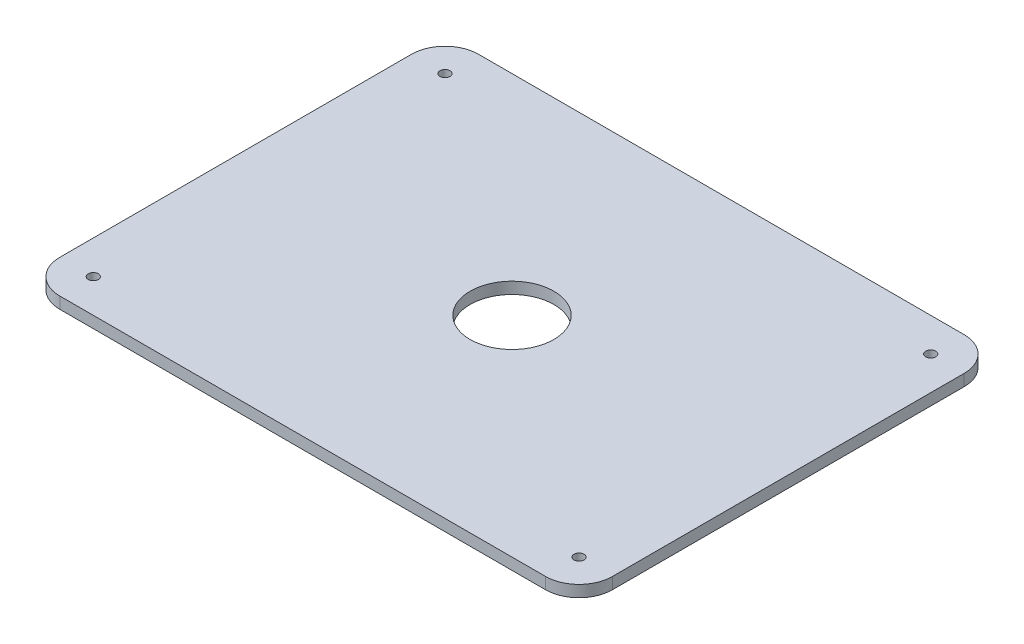
ISO-10303-21;
HEADER;
FILE_DESCRIPTION(('STEP AP214'),'2;1');
FILE_NAME('part.step','',(''),(''),'','','');
FILE_SCHEMA(('AUTOMOTIVE_DESIGN { 1 0 10303 214 1 1 1 1 }'));
ENDSEC;
DATA;
#1=APPLICATION_CONTEXT('core data for automotive mechanical design processes');
#2=APPLICATION_PROTOCOL_DEFINITION('international standard','automotive_design',2000,#1);
#3=PRODUCT_CONTEXT('',#1,'mechanical');
#4=PRODUCT('Part','Part','',(#3));
#5=PRODUCT_RELATED_PRODUCT_CATEGORY('part','',(#4));
#6=PRODUCT_DEFINITION_FORMATION('','',#4);
#7=PRODUCT_DEFINITION_CONTEXT('part definition',#1,'design');
#8=PRODUCT_DEFINITION('design','',#6,#7);
#9=PRODUCT_DEFINITION_SHAPE('','',#8);
#10=(LENGTH_UNIT() NAMED_UNIT(*) SI_UNIT(.MILLI.,.METRE.));
#11=(NAMED_UNIT(*) PLANE_ANGLE_UNIT() SI_UNIT($,.RADIAN.));
#12=(NAMED_UNIT(*) SI_UNIT($,.STERADIAN.) SOLID_ANGLE_UNIT());
#13=UNCERTAINTY_MEASURE_WITH_UNIT(LENGTH_MEASURE(1.E-05),#10,'distance_accuracy_value','');
#14=(GEOMETRIC_REPRESENTATION_CONTEXT(3) GLOBAL_UNCERTAINTY_ASSIGNED_CONTEXT((#13)) GLOBAL_UNIT_ASSIGNED_CONTEXT((#10,
#11,#12)) REPRESENTATION_CONTEXT('',''));
#15=CARTESIAN_POINT('',(0.,0.,0.));
#16=DIRECTION('',(0.,0.,1.));
#17=DIRECTION('',(1.,0.,0.));
#18=AXIS2_PLACEMENT_3D('',#15,#16,#17);
#19=CARTESIAN_POINT('',(-165.,6.9,125.));
#20=DIRECTION('',(1.,0.,0.));
#21=DIRECTION('',(0.,0.,-1.));
#22=AXIS2_PLACEMENT_3D('',#19,#20,#21);
#23=PLANE('',#22);
#24=DIRECTION('',(0.,0.,1.));
#25=VECTOR('',#24,1.);
#26=CARTESIAN_POINT('',(-165.,6.9,125.));
#27=LINE('',#26,#25);
#28=CARTESIAN_POINT('',(-165.,6.9,-105.));
#29=VERTEX_POINT('',#28);
#30=CARTESIAN_POINT('',(-165.,6.9,105.));
#31=VERTEX_POINT('',#30);
#32=EDGE_CURVE('E135',#29,#31,#27,.T.);
#33=ORIENTED_EDGE('',*,*,#32,.F.);
#34=DIRECTION('',(0.,-1.,0.));
#35=VECTOR('',#34,1.);
#36=CARTESIAN_POINT('',(-165.,6.9,-105.));
#37=LINE('',#36,#35);
#38=CARTESIAN_POINT('',(-165.,0.,-105.));
#39=VERTEX_POINT('',#38);
#40=EDGE_CURVE('E174',#29,#39,#37,.T.);
#41=ORIENTED_EDGE('',*,*,#40,.T.);
#42=DIRECTION('',(0.,0.,1.));
#43=VECTOR('',#42,1.);
#44=CARTESIAN_POINT('',(-165.,0.,125.));
#45=LINE('',#44,#43);
#46=CARTESIAN_POINT('',(-165.,0.,105.));
#47=VERTEX_POINT('',#46);
#48=EDGE_CURVE('E189',#39,#47,#45,.T.);
#49=ORIENTED_EDGE('',*,*,#48,.T.);
#50=DIRECTION('',(0.,-1.,0.));
#51=VECTOR('',#50,1.);
#52=CARTESIAN_POINT('',(-165.,6.9,105.));
#53=LINE('',#52,#51);
#54=EDGE_CURVE('E171',#47,#31,#53,.F.);
#55=ORIENTED_EDGE('',*,*,#54,.T.);
#56=EDGE_LOOP('',(#33,#41,#49,#55));
#57=FACE_BOUND('',#56,.T.);
#58=ADVANCED_FACE('F39',(#57),#23,.F.);
#59=CARTESIAN_POINT('',(-165.,6.9,125.));
#60=DIRECTION('',(0.,0.,-1.));
#61=DIRECTION('',(-1.,0.,0.));
#62=AXIS2_PLACEMENT_3D('',#59,#60,#61);
#63=PLANE('',#62);
#64=DIRECTION('',(1.,0.,0.));
#65=VECTOR('',#64,1.);
#66=CARTESIAN_POINT('',(-165.,6.9,125.));
#67=LINE('',#66,#65);
#68=CARTESIAN_POINT('',(-145.,6.9,125.));
#69=VERTEX_POINT('',#68);
#70=CARTESIAN_POINT('',(145.,6.9,125.));
#71=VERTEX_POINT('',#70);
#72=EDGE_CURVE('E140',#69,#71,#67,.T.);
#73=ORIENTED_EDGE('',*,*,#72,.F.);
#74=DIRECTION('',(0.,-1.,0.));
#75=VECTOR('',#74,1.);
#76=CARTESIAN_POINT('',(-145.,6.9,125.));
#77=LINE('',#76,#75);
#78=CARTESIAN_POINT('',(-145.,0.,125.));
#79=VERTEX_POINT('',#78);
#80=EDGE_CURVE('E11',#69,#79,#77,.T.);
#81=ORIENTED_EDGE('',*,*,#80,.T.);
#82=DIRECTION('',(1.,0.,0.));
#83=VECTOR('',#82,1.);
#84=CARTESIAN_POINT('',(-165.,0.,125.));
#85=LINE('',#84,#83);
#86=CARTESIAN_POINT('',(145.,0.,125.));
#87=VERTEX_POINT('',#86);
#88=EDGE_CURVE('E142',#79,#87,#85,.T.);
#89=ORIENTED_EDGE('',*,*,#88,.T.);
#90=DIRECTION('',(0.,-1.,0.));
#91=VECTOR('',#90,1.);
#92=CARTESIAN_POINT('',(145.,6.9,125.));
#93=LINE('',#92,#91);
#94=EDGE_CURVE('E48',#87,#71,#93,.F.);
#95=ORIENTED_EDGE('',*,*,#94,.T.);
#96=EDGE_LOOP('',(#73,#81,#89,#95));
#97=FACE_BOUND('',#96,.T.);
#98=ADVANCED_FACE('F195',(#97),#63,.F.);
#99=CARTESIAN_POINT('',(165.,6.9,125.));
#100=DIRECTION('',(-1.,0.,0.));
#101=DIRECTION('',(0.,0.,1.));
#102=AXIS2_PLACEMENT_3D('',#99,#100,#101);
#103=PLANE('',#102);
#104=DIRECTION('',(0.,0.,-1.));
#105=VECTOR('',#104,1.);
#106=CARTESIAN_POINT('',(165.,0.,125.));
#107=LINE('',#106,#105);
#108=CARTESIAN_POINT('',(165.,0.,105.));
#109=VERTEX_POINT('',#108);
#110=CARTESIAN_POINT('',(165.,0.,-105.));
#111=VERTEX_POINT('',#110);
#112=EDGE_CURVE('E136',#109,#111,#107,.T.);
#113=ORIENTED_EDGE('',*,*,#112,.T.);
#114=DIRECTION('',(0.,-1.,0.));
#115=VECTOR('',#114,1.);
#116=CARTESIAN_POINT('',(165.,6.9,-105.));
#117=LINE('',#116,#115);
#118=CARTESIAN_POINT('',(165.,6.9,-105.));
#119=VERTEX_POINT('',#118);
#120=EDGE_CURVE('E111',#111,#119,#117,.F.);
#121=ORIENTED_EDGE('',*,*,#120,.T.);
#122=DIRECTION('',(0.,0.,-1.));
#123=VECTOR('',#122,1.);
#124=CARTESIAN_POINT('',(165.,6.9,125.));
#125=LINE('',#124,#123);
#126=CARTESIAN_POINT('',(165.,6.9,105.));
#127=VERTEX_POINT('',#126);
#128=EDGE_CURVE('E180',#127,#119,#125,.T.);
#129=ORIENTED_EDGE('',*,*,#128,.F.);
#130=DIRECTION('',(0.,-1.,0.));
#131=VECTOR('',#130,1.);
#132=CARTESIAN_POINT('',(165.,6.9,105.));
#133=LINE('',#132,#131);
#134=EDGE_CURVE('E117',#127,#109,#133,.T.);
#135=ORIENTED_EDGE('',*,*,#134,.T.);
#136=EDGE_LOOP('',(#113,#121,#129,#135));
#137=FACE_BOUND('',#136,.T.);
#138=ADVANCED_FACE('F202',(#137),#103,.F.);
#139=CARTESIAN_POINT('',(-165.,6.9,-125.));
#140=DIRECTION('',(0.,0.,1.));
#141=DIRECTION('',(1.,0.,0.));
#142=AXIS2_PLACEMENT_3D('',#139,#140,#141);
#143=PLANE('',#142);
#144=DIRECTION('',(-1.,0.,0.));
#145=VECTOR('',#144,1.);
#146=CARTESIAN_POINT('',(-165.,6.9,-125.));
#147=LINE('',#146,#145);
#148=CARTESIAN_POINT('',(145.,6.9,-125.));
#149=VERTEX_POINT('',#148);
#150=CARTESIAN_POINT('',(-145.,6.9,-125.));
#151=VERTEX_POINT('',#150);
#152=EDGE_CURVE('E127',#149,#151,#147,.T.);
#153=ORIENTED_EDGE('',*,*,#152,.F.);
#154=DIRECTION('',(0.,-1.,0.));
#155=VECTOR('',#154,1.);
#156=CARTESIAN_POINT('',(145.,6.9,-125.));
#157=LINE('',#156,#155);
#158=CARTESIAN_POINT('',(145.,0.,-125.));
#159=VERTEX_POINT('',#158);
#160=EDGE_CURVE('E110',#149,#159,#157,.T.);
#161=ORIENTED_EDGE('',*,*,#160,.T.);
#162=DIRECTION('',(-1.,0.,0.));
#163=VECTOR('',#162,1.);
#164=CARTESIAN_POINT('',(-165.,0.,-125.));
#165=LINE('',#164,#163);
#166=CARTESIAN_POINT('',(-145.,0.,-125.));
#167=VERTEX_POINT('',#166);
#168=EDGE_CURVE('E124',#159,#167,#165,.T.);
#169=ORIENTED_EDGE('',*,*,#168,.T.);
#170=DIRECTION('',(0.,-1.,0.));
#171=VECTOR('',#170,1.);
#172=CARTESIAN_POINT('',(-145.,6.9,-125.));
#173=LINE('',#172,#171);
#174=EDGE_CURVE('E130',#167,#151,#173,.F.);
#175=ORIENTED_EDGE('',*,*,#174,.T.);
#176=EDGE_LOOP('',(#153,#161,#169,#175));
#177=FACE_BOUND('',#176,.T.);
#178=ADVANCED_FACE('F123',(#177),#143,.F.);
#179=CARTESIAN_POINT('',(0.,6.9,0.));
#180=DIRECTION('',(0.,-1.,0.));
#181=DIRECTION('',(0.,0.,-1.));
#182=AXIS2_PLACEMENT_3D('',#179,#180,#181);
#183=PLANE('',#182);
#184=CARTESIAN_POINT('',(0.,6.9,0.));
#185=DIRECTION('',(0.,1.,0.));
#186=DIRECTION('',(0.,0.,1.));
#187=AXIS2_PLACEMENT_3D('',#184,#185,#186);
#188=CIRCLE('',#187,25.);
#189=CARTESIAN_POINT('',(0.,6.9,25.));
#190=VERTEX_POINT('',#189);
#191=EDGE_CURVE('E378',#190,#190,#188,.T.);
#192=ORIENTED_EDGE('',*,*,#191,.F.);
#193=EDGE_LOOP('',(#192));
#194=FACE_BOUND('',#193,.T.);
#195=CARTESIAN_POINT('',(-145.,6.9,105.));
#196=DIRECTION('',(0.,1.,0.));
#197=DIRECTION('',(0.,0.,1.));
#198=AXIS2_PLACEMENT_3D('',#195,#196,#197);
#199=CIRCLE('',#198,2.99999999999999);
#200=CARTESIAN_POINT('',(-145.,6.9,108.));
#201=VERTEX_POINT('',#200);
#202=EDGE_CURVE('E358',#201,#201,#199,.T.);
#203=ORIENTED_EDGE('',*,*,#202,.F.);
#204=EDGE_LOOP('',(#203));
#205=FACE_BOUND('',#204,.T.);
#206=CARTESIAN_POINT('',(145.,6.9,105.));
#207=DIRECTION('',(0.,1.,0.));
#208=DIRECTION('',(0.,0.,1.));
#209=AXIS2_PLACEMENT_3D('',#206,#207,#208);
#210=CIRCLE('',#209,2.99999999999999);
#211=CARTESIAN_POINT('',(145.,6.9,108.));
#212=VERTEX_POINT('',#211);
#213=EDGE_CURVE('E367',#212,#212,#210,.T.);
#214=ORIENTED_EDGE('',*,*,#213,.F.);
#215=EDGE_LOOP('',(#214));
#216=FACE_BOUND('',#215,.T.);
#217=CARTESIAN_POINT('',(145.,6.9,-105.));
#218=DIRECTION('',(0.,1.,0.));
#219=DIRECTION('',(0.,0.,1.));
#220=AXIS2_PLACEMENT_3D('',#217,#218,#219);
#221=CIRCLE('',#220,2.99999999999999);
#222=CARTESIAN_POINT('',(145.,6.9,-102.));
#223=VERTEX_POINT('',#222);
#224=EDGE_CURVE('E355',#223,#223,#221,.T.);
#225=ORIENTED_EDGE('',*,*,#224,.F.);
#226=EDGE_LOOP('',(#225));
#227=FACE_BOUND('',#226,.T.);
#228=CARTESIAN_POINT('',(-145.,6.9,-105.));
#229=DIRECTION('',(0.,1.,0.));
#230=DIRECTION('',(0.,0.,1.));
#231=AXIS2_PLACEMENT_3D('',#228,#229,#230);
#232=CIRCLE('',#231,2.99999999999999);
#233=CARTESIAN_POINT('',(-145.,6.9,-102.));
#234=VERTEX_POINT('',#233);
#235=EDGE_CURVE('E347',#234,#234,#232,.T.);
#236=ORIENTED_EDGE('',*,*,#235,.F.);
#237=EDGE_LOOP('',(#236));
#238=FACE_BOUND('',#237,.T.);
#239=ORIENTED_EDGE('',*,*,#128,.T.);
#240=CARTESIAN_POINT('',(145.,6.9,-105.));
#241=DIRECTION('',(0.,-1.,0.));
#242=DIRECTION('',(0.,0.,-1.));
#243=AXIS2_PLACEMENT_3D('',#240,#241,#242);
#244=CIRCLE('',#243,20.);
#245=EDGE_CURVE('E168',#119,#149,#244,.F.);
#246=ORIENTED_EDGE('',*,*,#245,.T.);
#247=ORIENTED_EDGE('',*,*,#152,.T.);
#248=CARTESIAN_POINT('',(-145.,6.9,-105.));
#249=DIRECTION('',(0.,-1.,0.));
#250=DIRECTION('',(0.,0.,-1.));
#251=AXIS2_PLACEMENT_3D('',#248,#249,#250);
#252=CIRCLE('',#251,20.);
#253=EDGE_CURVE('E165',#151,#29,#252,.F.);
#254=ORIENTED_EDGE('',*,*,#253,.T.);
#255=ORIENTED_EDGE('',*,*,#32,.T.);
#256=CARTESIAN_POINT('',(-145.,6.9,105.));
#257=DIRECTION('',(0.,-1.,0.));
#258=DIRECTION('',(0.,0.,-1.));
#259=AXIS2_PLACEMENT_3D('',#256,#257,#258);
#260=CIRCLE('',#259,20.);
#261=EDGE_CURVE('E61',#31,#69,#260,.F.);
#262=ORIENTED_EDGE('',*,*,#261,.T.);
#263=ORIENTED_EDGE('',*,*,#72,.T.);
#264=CARTESIAN_POINT('',(145.,6.9,105.));
#265=DIRECTION('',(0.,-1.,0.));
#266=DIRECTION('',(0.,0.,-1.));
#267=AXIS2_PLACEMENT_3D('',#264,#265,#266);
#268=CIRCLE('',#267,20.);
#269=EDGE_CURVE('E160',#71,#127,#268,.F.);
#270=ORIENTED_EDGE('',*,*,#269,.T.);
#271=EDGE_LOOP('',(#239,#246,#247,#254,#255,#262,#263,#270));
#272=FACE_BOUND('',#271,.T.);
#273=ADVANCED_FACE('F200',(#194,#205,#216,#227,#238,#272),#183,.F.);
#274=CARTESIAN_POINT('',(0.,0.,0.));
#275=DIRECTION('',(0.,-1.,0.));
#276=DIRECTION('',(0.,0.,-1.));
#277=AXIS2_PLACEMENT_3D('',#274,#275,#276);
#278=PLANE('',#277);
#279=CARTESIAN_POINT('',(0.,0.,0.));
#280=DIRECTION('',(0.,1.,0.));
#281=DIRECTION('',(0.,0.,1.));
#282=AXIS2_PLACEMENT_3D('',#279,#280,#281);
#283=CIRCLE('',#282,25.);
#284=CARTESIAN_POINT('',(0.,0.,25.));
#285=VERTEX_POINT('',#284);
#286=EDGE_CURVE('E363',#285,#285,#283,.T.);
#287=ORIENTED_EDGE('',*,*,#286,.T.);
#288=EDGE_LOOP('',(#287));
#289=FACE_BOUND('',#288,.T.);
#290=CARTESIAN_POINT('',(-145.,0.,105.));
#291=DIRECTION('',(0.,1.,0.));
#292=DIRECTION('',(0.,0.,1.));
#293=AXIS2_PLACEMENT_3D('',#290,#291,#292);
#294=CIRCLE('',#293,2.99999999999999);
#295=CARTESIAN_POINT('',(-145.,0.,108.));
#296=VERTEX_POINT('',#295);
#297=EDGE_CURVE('E362',#296,#296,#294,.T.);
#298=ORIENTED_EDGE('',*,*,#297,.T.);
#299=EDGE_LOOP('',(#298));
#300=FACE_BOUND('',#299,.T.);
#301=CARTESIAN_POINT('',(145.,0.,105.));
#302=DIRECTION('',(0.,1.,0.));
#303=DIRECTION('',(0.,0.,1.));
#304=AXIS2_PLACEMENT_3D('',#301,#302,#303);
#305=CIRCLE('',#304,2.99999999999999);
#306=CARTESIAN_POINT('',(145.,0.,108.));
#307=VERTEX_POINT('',#306);
#308=EDGE_CURVE('E371',#307,#307,#305,.T.);
#309=ORIENTED_EDGE('',*,*,#308,.T.);
#310=EDGE_LOOP('',(#309));
#311=FACE_BOUND('',#310,.T.);
#312=CARTESIAN_POINT('',(145.,0.,-105.));
#313=DIRECTION('',(0.,1.,0.));
#314=DIRECTION('',(0.,0.,1.));
#315=AXIS2_PLACEMENT_3D('',#312,#313,#314);
#316=CIRCLE('',#315,2.99999999999999);
#317=CARTESIAN_POINT('',(145.,0.,-102.));
#318=VERTEX_POINT('',#317);
#319=EDGE_CURVE('E350',#318,#318,#316,.T.);
#320=ORIENTED_EDGE('',*,*,#319,.T.);
#321=EDGE_LOOP('',(#320));
#322=FACE_BOUND('',#321,.T.);
#323=CARTESIAN_POINT('',(-145.,0.,-105.));
#324=DIRECTION('',(0.,1.,0.));
#325=DIRECTION('',(0.,0.,1.));
#326=AXIS2_PLACEMENT_3D('',#323,#324,#325);
#327=CIRCLE('',#326,2.99999999999999);
#328=CARTESIAN_POINT('',(-145.,0.,-102.));
#329=VERTEX_POINT('',#328);
#330=EDGE_CURVE('E192',#329,#329,#327,.T.);
#331=ORIENTED_EDGE('',*,*,#330,.T.);
#332=EDGE_LOOP('',(#331));
#333=FACE_BOUND('',#332,.T.);
#334=ORIENTED_EDGE('',*,*,#168,.F.);
#335=CARTESIAN_POINT('',(145.,0.,-105.));
#336=DIRECTION('',(0.,-1.,0.));
#337=DIRECTION('',(0.,0.,-1.));
#338=AXIS2_PLACEMENT_3D('',#335,#336,#337);
#339=CIRCLE('',#338,20.);
#340=EDGE_CURVE('E106',#159,#111,#339,.T.);
#341=ORIENTED_EDGE('',*,*,#340,.T.);
#342=ORIENTED_EDGE('',*,*,#112,.F.);
#343=CARTESIAN_POINT('',(145.,0.,105.));
#344=DIRECTION('',(0.,-1.,0.));
#345=DIRECTION('',(0.,0.,-1.));
#346=AXIS2_PLACEMENT_3D('',#343,#344,#345);
#347=CIRCLE('',#346,20.);
#348=EDGE_CURVE('E129',#109,#87,#347,.T.);
#349=ORIENTED_EDGE('',*,*,#348,.T.);
#350=ORIENTED_EDGE('',*,*,#88,.F.);
#351=CARTESIAN_POINT('',(-145.,0.,105.));
#352=DIRECTION('',(0.,-1.,0.));
#353=DIRECTION('',(0.,0.,-1.));
#354=AXIS2_PLACEMENT_3D('',#351,#352,#353);
#355=CIRCLE('',#354,20.);
#356=EDGE_CURVE('E150',#79,#47,#355,.T.);
#357=ORIENTED_EDGE('',*,*,#356,.T.);
#358=ORIENTED_EDGE('',*,*,#48,.F.);
#359=CARTESIAN_POINT('',(-145.,0.,-105.));
#360=DIRECTION('',(0.,-1.,0.));
#361=DIRECTION('',(0.,0.,-1.));
#362=AXIS2_PLACEMENT_3D('',#359,#360,#361);
#363=CIRCLE('',#362,20.);
#364=EDGE_CURVE('E118',#39,#167,#363,.T.);
#365=ORIENTED_EDGE('',*,*,#364,.T.);
#366=EDGE_LOOP('',(#334,#341,#342,#349,#350,#357,#358,#365));
#367=FACE_BOUND('',#366,.T.);
#368=ADVANCED_FACE('F132',(#289,#300,#311,#322,#333,#367),#278,.T.);
#369=CARTESIAN_POINT('',(-145.,0.,-105.));
#370=DIRECTION('',(0.,1.,0.));
#371=DIRECTION('',(0.,0.,1.));
#372=AXIS2_PLACEMENT_3D('',#369,#370,#371);
#373=CYLINDRICAL_SURFACE('',#372,2.99999999999999);
#374=ORIENTED_EDGE('',*,*,#330,.F.);
#375=EDGE_LOOP('',(#374));
#376=FACE_BOUND('',#375,.T.);
#377=ORIENTED_EDGE('',*,*,#235,.T.);
#378=EDGE_LOOP('',(#377));
#379=FACE_BOUND('',#378,.T.);
#380=ADVANCED_FACE('F262',(#376,#379),#373,.F.);
#381=CARTESIAN_POINT('',(145.,0.,-105.));
#382=DIRECTION('',(0.,1.,0.));
#383=DIRECTION('',(0.,0.,1.));
#384=AXIS2_PLACEMENT_3D('',#381,#382,#383);
#385=CYLINDRICAL_SURFACE('',#384,2.99999999999999);
#386=ORIENTED_EDGE('',*,*,#319,.F.);
#387=EDGE_LOOP('',(#386));
#388=FACE_BOUND('',#387,.T.);
#389=ORIENTED_EDGE('',*,*,#224,.T.);
#390=EDGE_LOOP('',(#389));
#391=FACE_BOUND('',#390,.T.);
#392=ADVANCED_FACE('F321',(#388,#391),#385,.F.);
#393=CARTESIAN_POINT('',(145.,0.,105.));
#394=DIRECTION('',(0.,1.,0.));
#395=DIRECTION('',(0.,0.,1.));
#396=AXIS2_PLACEMENT_3D('',#393,#394,#395);
#397=CYLINDRICAL_SURFACE('',#396,2.99999999999999);
#398=ORIENTED_EDGE('',*,*,#308,.F.);
#399=EDGE_LOOP('',(#398));
#400=FACE_BOUND('',#399,.T.);
#401=ORIENTED_EDGE('',*,*,#213,.T.);
#402=EDGE_LOOP('',(#401));
#403=FACE_BOUND('',#402,.T.);
#404=ADVANCED_FACE('F311',(#400,#403),#397,.F.);
#405=CARTESIAN_POINT('',(-145.,0.,105.));
#406=DIRECTION('',(0.,1.,0.));
#407=DIRECTION('',(0.,0.,1.));
#408=AXIS2_PLACEMENT_3D('',#405,#406,#407);
#409=CYLINDRICAL_SURFACE('',#408,2.99999999999999);
#410=ORIENTED_EDGE('',*,*,#297,.F.);
#411=EDGE_LOOP('',(#410));
#412=FACE_BOUND('',#411,.T.);
#413=ORIENTED_EDGE('',*,*,#202,.T.);
#414=EDGE_LOOP('',(#413));
#415=FACE_BOUND('',#414,.T.);
#416=ADVANCED_FACE('F301',(#412,#415),#409,.F.);
#417=CARTESIAN_POINT('',(0.,0.,0.));
#418=DIRECTION('',(0.,1.,0.));
#419=DIRECTION('',(0.,0.,1.));
#420=AXIS2_PLACEMENT_3D('',#417,#418,#419);
#421=CYLINDRICAL_SURFACE('',#420,25.);
#422=ORIENTED_EDGE('',*,*,#286,.F.);
#423=EDGE_LOOP('',(#422));
#424=FACE_BOUND('',#423,.T.);
#425=ORIENTED_EDGE('',*,*,#191,.T.);
#426=EDGE_LOOP('',(#425));
#427=FACE_BOUND('',#426,.T.);
#428=ADVANCED_FACE('F221',(#424,#427),#421,.F.);
#429=CARTESIAN_POINT('',(145.,6.9,-105.));
#430=DIRECTION('',(0.,-1.,0.));
#431=DIRECTION('',(0.,0.,-1.));
#432=AXIS2_PLACEMENT_3D('',#429,#430,#431);
#433=CYLINDRICAL_SURFACE('',#432,20.);
#434=ORIENTED_EDGE('',*,*,#245,.F.);
#435=ORIENTED_EDGE('',*,*,#120,.F.);
#436=ORIENTED_EDGE('',*,*,#340,.F.);
#437=ORIENTED_EDGE('',*,*,#160,.F.);
#438=EDGE_LOOP('',(#434,#435,#436,#437));
#439=FACE_BOUND('',#438,.T.);
#440=ADVANCED_FACE('F109',(#439),#433,.T.);
#441=CARTESIAN_POINT('',(-145.,6.9,-105.));
#442=DIRECTION('',(0.,-1.,0.));
#443=DIRECTION('',(0.,0.,-1.));
#444=AXIS2_PLACEMENT_3D('',#441,#442,#443);
#445=CYLINDRICAL_SURFACE('',#444,20.);
#446=ORIENTED_EDGE('',*,*,#253,.F.);
#447=ORIENTED_EDGE('',*,*,#174,.F.);
#448=ORIENTED_EDGE('',*,*,#364,.F.);
#449=ORIENTED_EDGE('',*,*,#40,.F.);
#450=EDGE_LOOP('',(#446,#447,#448,#449));
#451=FACE_BOUND('',#450,.T.);
#452=ADVANCED_FACE('F220',(#451),#445,.T.);
#453=CARTESIAN_POINT('',(-145.,6.9,105.));
#454=DIRECTION('',(0.,-1.,0.));
#455=DIRECTION('',(0.,0.,-1.));
#456=AXIS2_PLACEMENT_3D('',#453,#454,#455);
#457=CYLINDRICAL_SURFACE('',#456,20.);
#458=ORIENTED_EDGE('',*,*,#261,.F.);
#459=ORIENTED_EDGE('',*,*,#54,.F.);
#460=ORIENTED_EDGE('',*,*,#356,.F.);
#461=ORIENTED_EDGE('',*,*,#80,.F.);
#462=EDGE_LOOP('',(#458,#459,#460,#461));
#463=FACE_BOUND('',#462,.T.);
#464=ADVANCED_FACE('F223',(#463),#457,.T.);
#465=CARTESIAN_POINT('',(145.,6.9,105.));
#466=DIRECTION('',(0.,-1.,0.));
#467=DIRECTION('',(0.,0.,-1.));
#468=AXIS2_PLACEMENT_3D('',#465,#466,#467);
#469=CYLINDRICAL_SURFACE('',#468,20.);
#470=ORIENTED_EDGE('',*,*,#269,.F.);
#471=ORIENTED_EDGE('',*,*,#94,.F.);
#472=ORIENTED_EDGE('',*,*,#348,.F.);
#473=ORIENTED_EDGE('',*,*,#134,.F.);
#474=EDGE_LOOP('',(#470,#471,#472,#473));
#475=FACE_BOUND('',#474,.T.);
#476=ADVANCED_FACE('F41',(#475),#469,.T.);
#477=CLOSED_SHELL('',(#58,#98,#138,#178,#273,#368,#380,#392,#404,#416,#428,#440,#452,#464,#476));
#478=MANIFOLD_SOLID_BREP('B2',#477);
#479=ADVANCED_BREP_SHAPE_REPRESENTATION('',(#18,#478),#14);
#480=SHAPE_DEFINITION_REPRESENTATION(#9,#479);
ENDSEC;
END-ISO-10303-21;
